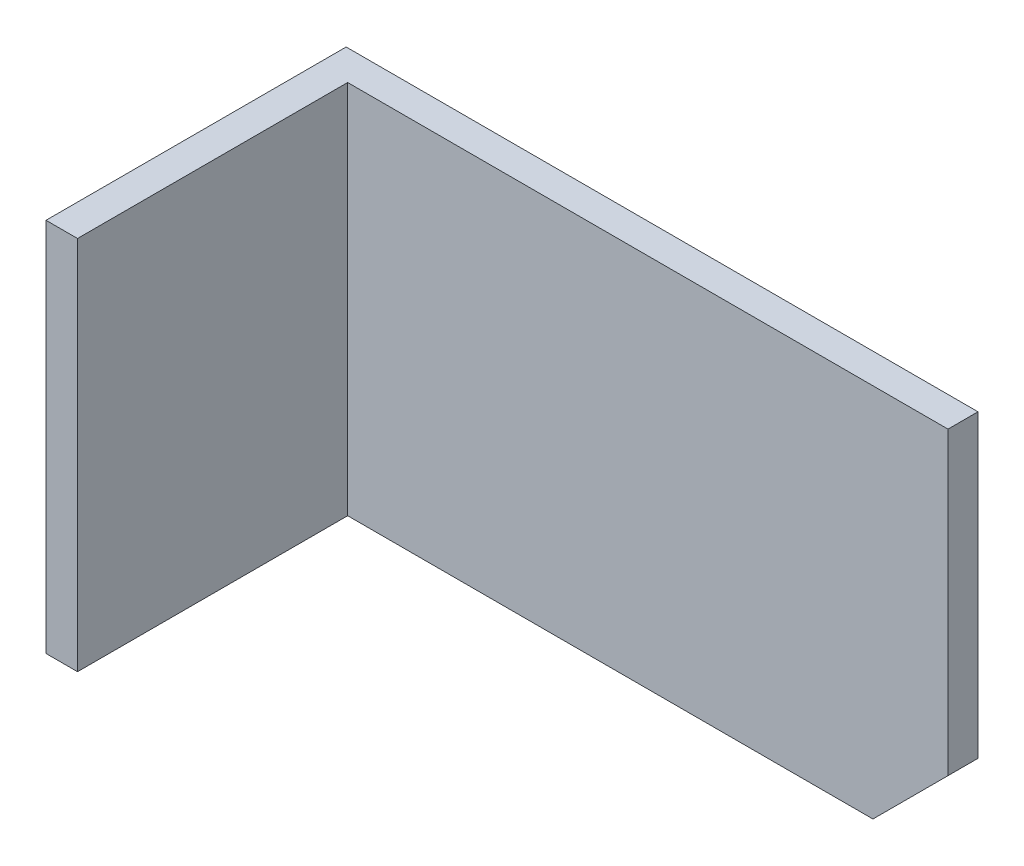
ISO-10303-21;
HEADER;
FILE_DESCRIPTION(('STEP AP214'),'2;1');
FILE_NAME('part.step','',(''),(''),'','','');
FILE_SCHEMA(('AUTOMOTIVE_DESIGN { 1 0 10303 214 1 1 1 1 }'));
ENDSEC;
DATA;
#1=APPLICATION_CONTEXT('core data for automotive mechanical design processes');
#2=APPLICATION_PROTOCOL_DEFINITION('international standard','automotive_design',2000,#1);
#3=PRODUCT_CONTEXT('',#1,'mechanical');
#4=PRODUCT('Part','Part','',(#3));
#5=PRODUCT_RELATED_PRODUCT_CATEGORY('part','',(#4));
#6=PRODUCT_DEFINITION_FORMATION('','',#4);
#7=PRODUCT_DEFINITION_CONTEXT('part definition',#1,'design');
#8=PRODUCT_DEFINITION('design','',#6,#7);
#9=PRODUCT_DEFINITION_SHAPE('','',#8);
#10=(LENGTH_UNIT() NAMED_UNIT(*) SI_UNIT(.MILLI.,.METRE.));
#11=(NAMED_UNIT(*) PLANE_ANGLE_UNIT() SI_UNIT($,.RADIAN.));
#12=(NAMED_UNIT(*) SI_UNIT($,.STERADIAN.) SOLID_ANGLE_UNIT());
#13=UNCERTAINTY_MEASURE_WITH_UNIT(LENGTH_MEASURE(1.E-05),#10,'distance_accuracy_value','');
#14=(GEOMETRIC_REPRESENTATION_CONTEXT(3) GLOBAL_UNCERTAINTY_ASSIGNED_CONTEXT((#13)) GLOBAL_UNIT_ASSIGNED_CONTEXT((#10,
#11,#12)) REPRESENTATION_CONTEXT('',''));
#15=CARTESIAN_POINT('',(0.,0.,0.));
#16=DIRECTION('',(0.,0.,1.));
#17=DIRECTION('',(1.,0.,0.));
#18=AXIS2_PLACEMENT_3D('',#15,#16,#17);
#19=CARTESIAN_POINT('',(-1.53882069959544,-0.75,0.2));
#20=DIRECTION('',(0.,0.,1.));
#21=DIRECTION('',(1.,0.,0.));
#22=AXIS2_PLACEMENT_3D('',#19,#20,#21);
#23=PLANE('',#22);
#24=DIRECTION('',(0.,-1.,0.));
#25=VECTOR('',#24,1.);
#26=CARTESIAN_POINT('',(-1.54932069959544,-0.75,0.2));
#27=LINE('',#26,#25);
#28=CARTESIAN_POINT('',(-1.54932069959544,-0.625,0.2));
#29=VERTEX_POINT('',#28);
#30=CARTESIAN_POINT('',(-1.54932069959544,-0.875,0.2));
#31=VERTEX_POINT('',#30);
#32=EDGE_CURVE('E100',#29,#31,#27,.T.);
#33=ORIENTED_EDGE('',*,*,#32,.T.);
#34=DIRECTION('',(1.,0.,0.));
#35=VECTOR('',#34,1.);
#36=CARTESIAN_POINT('',(-1.41898707437652,-0.875,0.2));
#37=LINE('',#36,#35);
#38=CARTESIAN_POINT('',(-1.52832069959544,-0.875,0.2));
#39=VERTEX_POINT('',#38);
#40=EDGE_CURVE('E96',#31,#39,#37,.T.);
#41=ORIENTED_EDGE('',*,*,#40,.T.);
#42=DIRECTION('',(0.,-1.,0.));
#43=VECTOR('',#42,1.);
#44=CARTESIAN_POINT('',(-1.52832069959544,-0.75,0.2));
#45=LINE('',#44,#43);
#46=CARTESIAN_POINT('',(-1.52832069959544,-0.625,0.2));
#47=VERTEX_POINT('',#46);
#48=EDGE_CURVE('E11',#47,#39,#45,.T.);
#49=ORIENTED_EDGE('',*,*,#48,.F.);
#50=DIRECTION('',(1.,0.,0.));
#51=VECTOR('',#50,1.);
#52=CARTESIAN_POINT('',(-1.39679171408819,-0.625,0.2));
#53=LINE('',#52,#51);
#54=EDGE_CURVE('E145',#29,#47,#53,.T.);
#55=ORIENTED_EDGE('',*,*,#54,.F.);
#56=EDGE_LOOP('',(#33,#41,#49,#55));
#57=FACE_BOUND('',#56,.T.);
#58=ADVANCED_FACE('F16',(#57),#23,.T.);
#59=CARTESIAN_POINT('',(-1.52832069959544,-0.75,0.11));
#60=DIRECTION('',(1.,0.,0.));
#61=DIRECTION('',(0.,1.,0.));
#62=AXIS2_PLACEMENT_3D('',#59,#60,#61);
#63=PLANE('',#62);
#64=DIRECTION('',(0.,0.,-1.));
#65=VECTOR('',#64,1.);
#66=CARTESIAN_POINT('',(-1.52832069959544,-0.625,0.0420289855072459));
#67=LINE('',#66,#65);
#68=CARTESIAN_POINT('',(-1.52832069959544,-0.625,0.02));
#69=VERTEX_POINT('',#68);
#70=EDGE_CURVE('E149',#47,#69,#67,.T.);
#71=ORIENTED_EDGE('',*,*,#70,.F.);
#72=ORIENTED_EDGE('',*,*,#48,.T.);
#73=DIRECTION('',(0.,0.,-1.));
#74=VECTOR('',#73,1.);
#75=CARTESIAN_POINT('',(-1.52832069959544,-0.875,0.0448336252189136));
#76=LINE('',#75,#74);
#77=CARTESIAN_POINT('',(-1.52832069959544,-0.875,0.02));
#78=VERTEX_POINT('',#77);
#79=EDGE_CURVE('E130',#39,#78,#76,.T.);
#80=ORIENTED_EDGE('',*,*,#79,.T.);
#81=DIRECTION('',(0.,-1.,0.));
#82=VECTOR('',#81,1.);
#83=CARTESIAN_POINT('',(-1.52832069959544,-0.746711342510853,0.02));
#84=LINE('',#83,#82);
#85=EDGE_CURVE('E27',#69,#78,#84,.T.);
#86=ORIENTED_EDGE('',*,*,#85,.F.);
#87=EDGE_LOOP('',(#71,#72,#80,#86));
#88=FACE_BOUND('',#87,.T.);
#89=ADVANCED_FACE('F177',(#88),#63,.T.);
#90=CARTESIAN_POINT('',(-1.33333807407652,-0.746711342510853,0.02));
#91=DIRECTION('',(0.,0.,1.));
#92=DIRECTION('',(1.,0.,0.));
#93=AXIS2_PLACEMENT_3D('',#90,#91,#92);
#94=PLANE('',#93);
#95=DIRECTION('',(0.,-1.,0.));
#96=VECTOR('',#95,1.);
#97=CARTESIAN_POINT('',(-1.12832069959544,-0.725,0.02));
#98=LINE('',#97,#96);
#99=CARTESIAN_POINT('',(-1.12832069959544,-0.625,0.02));
#100=VERTEX_POINT('',#99);
#101=CARTESIAN_POINT('',(-1.12832069959544,-0.825,0.02));
#102=VERTEX_POINT('',#101);
#103=EDGE_CURVE('E42',#100,#102,#98,.T.);
#104=ORIENTED_EDGE('',*,*,#103,.F.);
#105=DIRECTION('',(1.,0.,0.));
#106=VECTOR('',#105,1.);
#107=CARTESIAN_POINT('',(-1.39679171408819,-0.625,0.02));
#108=LINE('',#107,#106);
#109=EDGE_CURVE('E139',#69,#100,#108,.T.);
#110=ORIENTED_EDGE('',*,*,#109,.F.);
#111=ORIENTED_EDGE('',*,*,#85,.T.);
#112=DIRECTION('',(1.,0.,0.));
#113=VECTOR('',#112,1.);
#114=CARTESIAN_POINT('',(-1.41898707437652,-0.875,0.02));
#115=LINE('',#114,#113);
#116=CARTESIAN_POINT('',(-1.17832069959544,-0.875,0.02));
#117=VERTEX_POINT('',#116);
#118=EDGE_CURVE('E134',#78,#117,#115,.T.);
#119=ORIENTED_EDGE('',*,*,#118,.T.);
#120=DIRECTION('',(0.707106781186549,0.707106781186546,0.));
#121=VECTOR('',#120,1.);
#122=CARTESIAN_POINT('',(-1.15332069959544,-0.85,0.02));
#123=LINE('',#122,#121);
#124=EDGE_CURVE('E129',#117,#102,#123,.T.);
#125=ORIENTED_EDGE('',*,*,#124,.T.);
#126=EDGE_LOOP('',(#104,#110,#111,#119,#125));
#127=FACE_BOUND('',#126,.T.);
#128=ADVANCED_FACE('F18',(#127),#94,.T.);
#129=CARTESIAN_POINT('',(-1.12832069959544,-0.725,0.01));
#130=DIRECTION('',(1.,0.,0.));
#131=DIRECTION('',(0.,0.,-1.));
#132=AXIS2_PLACEMENT_3D('',#129,#130,#131);
#133=PLANE('',#132);
#134=DIRECTION('',(0.,0.,-1.));
#135=VECTOR('',#134,1.);
#136=CARTESIAN_POINT('',(-1.12832069959544,-0.825,0.01));
#137=LINE('',#136,#135);
#138=CARTESIAN_POINT('',(-1.12832069959544,-0.825,0.));
#139=VERTEX_POINT('',#138);
#140=EDGE_CURVE('E125',#102,#139,#137,.T.);
#141=ORIENTED_EDGE('',*,*,#140,.T.);
#142=DIRECTION('',(0.,1.,0.));
#143=VECTOR('',#142,1.);
#144=CARTESIAN_POINT('',(-1.12832069959544,-0.746816562660918,0.));
#145=LINE('',#144,#143);
#146=CARTESIAN_POINT('',(-1.12832069959544,-0.625,0.));
#147=VERTEX_POINT('',#146);
#148=EDGE_CURVE('E122',#139,#147,#145,.T.);
#149=ORIENTED_EDGE('',*,*,#148,.T.);
#150=DIRECTION('',(0.,0.,-1.));
#151=VECTOR('',#150,1.);
#152=CARTESIAN_POINT('',(-1.12832069959544,-0.625,0.0420289855072459));
#153=LINE('',#152,#151);
#154=EDGE_CURVE('E135',#100,#147,#153,.T.);
#155=ORIENTED_EDGE('',*,*,#154,.F.);
#156=ORIENTED_EDGE('',*,*,#103,.T.);
#157=EDGE_LOOP('',(#141,#149,#155,#156));
#158=FACE_BOUND('',#157,.T.);
#159=ADVANCED_FACE('F213',(#158),#133,.T.);
#160=CARTESIAN_POINT('',(-1.39679171408819,-0.625,0.0420289855072459));
#161=DIRECTION('',(0.,1.,0.));
#162=DIRECTION('',(0.,0.,-1.));
#163=AXIS2_PLACEMENT_3D('',#160,#161,#162);
#164=PLANE('',#163);
#165=DIRECTION('',(0.,0.,1.));
#166=VECTOR('',#165,1.);
#167=CARTESIAN_POINT('',(-1.54932069959544,-0.625,0.0999999999999988));
#168=LINE('',#167,#166);
#169=CARTESIAN_POINT('',(-1.54932069959544,-0.625,0.));
#170=VERTEX_POINT('',#169);
#171=EDGE_CURVE('E105',#170,#29,#168,.T.);
#172=ORIENTED_EDGE('',*,*,#171,.T.);
#173=ORIENTED_EDGE('',*,*,#54,.T.);
#174=ORIENTED_EDGE('',*,*,#70,.T.);
#175=ORIENTED_EDGE('',*,*,#109,.T.);
#176=ORIENTED_EDGE('',*,*,#154,.T.);
#177=DIRECTION('',(-1.,0.,0.));
#178=VECTOR('',#177,1.);
#179=CARTESIAN_POINT('',(-1.34391182083059,-0.625,0.));
#180=LINE('',#179,#178);
#181=EDGE_CURVE('E110',#147,#170,#180,.T.);
#182=ORIENTED_EDGE('',*,*,#181,.T.);
#183=EDGE_LOOP('',(#172,#173,#174,#175,#176,#182));
#184=FACE_BOUND('',#183,.T.);
#185=ADVANCED_FACE('F155',(#184),#164,.T.);
#186=CARTESIAN_POINT('',(-1.54932069959544,-0.75,0.0999999999999988));
#187=DIRECTION('',(1.,0.,0.));
#188=DIRECTION('',(0.,1.,0.));
#189=AXIS2_PLACEMENT_3D('',#186,#187,#188);
#190=PLANE('',#189);
#191=DIRECTION('',(0.,-1.,0.));
#192=VECTOR('',#191,1.);
#193=CARTESIAN_POINT('',(-1.54932069959544,-0.746816562660918,0.));
#194=LINE('',#193,#192);
#195=CARTESIAN_POINT('',(-1.54932069959544,-0.875,0.));
#196=VERTEX_POINT('',#195);
#197=EDGE_CURVE('E102',#170,#196,#194,.T.);
#198=ORIENTED_EDGE('',*,*,#197,.T.);
#199=DIRECTION('',(0.,0.,1.));
#200=VECTOR('',#199,1.);
#201=CARTESIAN_POINT('',(-1.54932069959544,-0.875,0.0448336252189136));
#202=LINE('',#201,#200);
#203=EDGE_CURVE('E20',#196,#31,#202,.T.);
#204=ORIENTED_EDGE('',*,*,#203,.T.);
#205=ORIENTED_EDGE('',*,*,#32,.F.);
#206=ORIENTED_EDGE('',*,*,#171,.F.);
#207=EDGE_LOOP('',(#198,#204,#205,#206));
#208=FACE_BOUND('',#207,.T.);
#209=ADVANCED_FACE('F103',(#208),#190,.F.);
#210=CARTESIAN_POINT('',(-1.41898707437652,-0.875,0.0448336252189136));
#211=DIRECTION('',(0.,1.,0.));
#212=DIRECTION('',(0.,0.,-1.));
#213=AXIS2_PLACEMENT_3D('',#210,#211,#212);
#214=PLANE('',#213);
#215=ORIENTED_EDGE('',*,*,#118,.F.);
#216=ORIENTED_EDGE('',*,*,#79,.F.);
#217=ORIENTED_EDGE('',*,*,#40,.F.);
#218=ORIENTED_EDGE('',*,*,#203,.F.);
#219=DIRECTION('',(1.,0.,0.));
#220=VECTOR('',#219,1.);
#221=CARTESIAN_POINT('',(-1.34391182083059,-0.875,0.));
#222=LINE('',#221,#220);
#223=CARTESIAN_POINT('',(-1.17832069959544,-0.875,0.));
#224=VERTEX_POINT('',#223);
#225=EDGE_CURVE('E93',#196,#224,#222,.T.);
#226=ORIENTED_EDGE('',*,*,#225,.T.);
#227=DIRECTION('',(0.,0.,1.));
#228=VECTOR('',#227,1.);
#229=CARTESIAN_POINT('',(-1.17832069959544,-0.875,0.01));
#230=LINE('',#229,#228);
#231=EDGE_CURVE('E79',#224,#117,#230,.T.);
#232=ORIENTED_EDGE('',*,*,#231,.T.);
#233=EDGE_LOOP('',(#215,#216,#217,#218,#226,#232));
#234=FACE_BOUND('',#233,.T.);
#235=ADVANCED_FACE('F91',(#234),#214,.F.);
#236=CARTESIAN_POINT('',(-1.15332069959544,-0.85,0.01));
#237=DIRECTION('',(-0.707106781186546,0.707106781186549,0.));
#238=DIRECTION('',(0.,0.,1.));
#239=AXIS2_PLACEMENT_3D('',#236,#237,#238);
#240=PLANE('',#239);
#241=ORIENTED_EDGE('',*,*,#140,.F.);
#242=ORIENTED_EDGE('',*,*,#124,.F.);
#243=ORIENTED_EDGE('',*,*,#231,.F.);
#244=DIRECTION('',(0.707106781186534,0.707106781186561,0.));
#245=VECTOR('',#244,1.);
#246=CARTESIAN_POINT('',(-1.17832069959543,-0.875,0.));
#247=LINE('',#246,#245);
#248=EDGE_CURVE('E114',#224,#139,#247,.T.);
#249=ORIENTED_EDGE('',*,*,#248,.T.);
#250=EDGE_LOOP('',(#241,#242,#243,#249));
#251=FACE_BOUND('',#250,.T.);
#252=ADVANCED_FACE('F181',(#251),#240,.F.);
#253=CARTESIAN_POINT('',(-1.34391182083059,-0.746816562660918,0.));
#254=DIRECTION('',(0.,0.,1.));
#255=DIRECTION('',(1.,0.,0.));
#256=AXIS2_PLACEMENT_3D('',#253,#254,#255);
#257=PLANE('',#256);
#258=ORIENTED_EDGE('',*,*,#225,.F.);
#259=ORIENTED_EDGE('',*,*,#197,.F.);
#260=ORIENTED_EDGE('',*,*,#181,.F.);
#261=ORIENTED_EDGE('',*,*,#148,.F.);
#262=ORIENTED_EDGE('',*,*,#248,.F.);
#263=EDGE_LOOP('',(#258,#259,#260,#261,#262));
#264=FACE_BOUND('',#263,.T.);
#265=ADVANCED_FACE('F112',(#264),#257,.F.);
#266=CLOSED_SHELL('',(#58,#89,#128,#159,#185,#209,#235,#252,#265));
#267=MANIFOLD_SOLID_BREP('B1',#266);
#268=ADVANCED_BREP_SHAPE_REPRESENTATION('',(#18,#267),#14);
#269=SHAPE_DEFINITION_REPRESENTATION(#9,#268);
ENDSEC;
END-ISO-10303-21;
